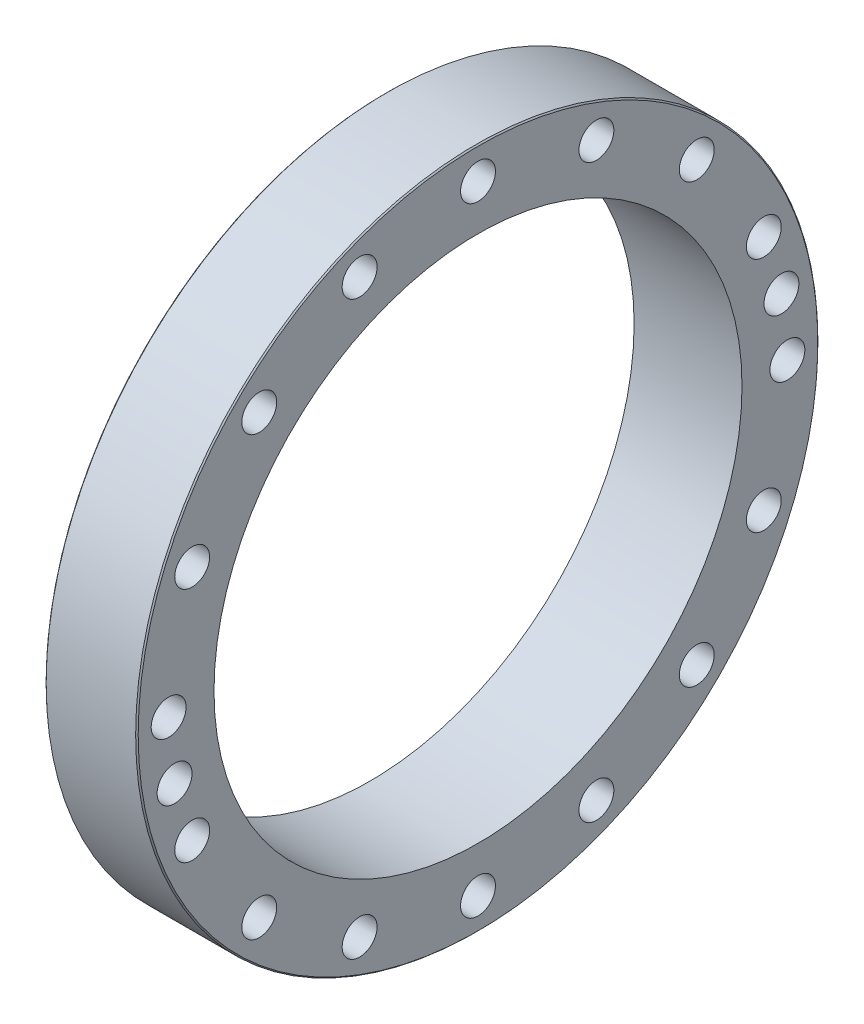
ISO-10303-21;
HEADER;
FILE_DESCRIPTION(('STEP AP214'),'2;1');
FILE_NAME('part.step','',(''),(''),'','','');
FILE_SCHEMA(('AUTOMOTIVE_DESIGN { 1 0 10303 214 1 1 1 1 }'));
ENDSEC;
DATA;
#1=APPLICATION_CONTEXT('core data for automotive mechanical design processes');
#2=APPLICATION_PROTOCOL_DEFINITION('international standard','automotive_design',2000,#1);
#3=PRODUCT_CONTEXT('',#1,'mechanical');
#4=PRODUCT('Part','Part','',(#3));
#5=PRODUCT_RELATED_PRODUCT_CATEGORY('part','',(#4));
#6=PRODUCT_DEFINITION_FORMATION('','',#4);
#7=PRODUCT_DEFINITION_CONTEXT('part definition',#1,'design');
#8=PRODUCT_DEFINITION('design','',#6,#7);
#9=PRODUCT_DEFINITION_SHAPE('','',#8);
#10=(LENGTH_UNIT() NAMED_UNIT(*) SI_UNIT(.MILLI.,.METRE.));
#11=(NAMED_UNIT(*) PLANE_ANGLE_UNIT() SI_UNIT($,.RADIAN.));
#12=(NAMED_UNIT(*) SI_UNIT($,.STERADIAN.) SOLID_ANGLE_UNIT());
#13=UNCERTAINTY_MEASURE_WITH_UNIT(LENGTH_MEASURE(1.E-05),#10,'distance_accuracy_value','');
#14=(GEOMETRIC_REPRESENTATION_CONTEXT(3) GLOBAL_UNCERTAINTY_ASSIGNED_CONTEXT((#13)) GLOBAL_UNIT_ASSIGNED_CONTEXT((#10,
#11,#12)) REPRESENTATION_CONTEXT('',''));
#15=CARTESIAN_POINT('',(0.,0.,0.));
#16=DIRECTION('',(0.,0.,1.));
#17=DIRECTION('',(1.,0.,0.));
#18=AXIS2_PLACEMENT_3D('',#15,#16,#17);
#19=CARTESIAN_POINT('',(60.1,-19.0213063965725,95.626564839315));
#20=DIRECTION('',(-1.,0.,0.));
#21=DIRECTION('',(0.,0.,1.));
#22=AXIS2_PLACEMENT_3D('',#19,#20,#21);
#23=CYLINDRICAL_SURFACE('',#22,4.25);
#24=CARTESIAN_POINT('',(66.8499999999312,-19.0213063965725,95.626564839315));
#25=DIRECTION('',(1.,0.,0.));
#26=DIRECTION('',(0.,0.195090322018536,-0.980785280402751));
#27=AXIS2_PLACEMENT_3D('',#24,#25,#26);
#28=CIRCLE('',#27,4.24999999995026);
#29=CARTESIAN_POINT('',(66.8499999999312,-18.1921725280034,91.4582273976521));
#30=VERTEX_POINT('',#29);
#31=EDGE_CURVE('E29',#30,#30,#28,.T.);
#32=ORIENTED_EDGE('',*,*,#31,.T.);
#33=EDGE_LOOP('',(#32));
#34=FACE_BOUND('',#33,.T.);
#35=CARTESIAN_POINT('',(53.3500000000231,-19.0213063965725,95.626564839315));
#36=DIRECTION('',(-1.,0.,0.));
#37=DIRECTION('',(0.,0.195090322016634,-0.98078528040313));
#38=AXIS2_PLACEMENT_3D('',#35,#36,#37);
#39=CIRCLE('',#38,4.25000000006453);
#40=CARTESIAN_POINT('',(53.3500000000231,-18.1921725279892,91.4582273975384));
#41=VERTEX_POINT('',#40);
#42=EDGE_CURVE('E172',#41,#41,#39,.T.);
#43=ORIENTED_EDGE('',*,*,#42,.T.);
#44=EDGE_LOOP('',(#43));
#45=FACE_BOUND('',#44,.T.);
#46=ADVANCED_FACE('F14',(#34,#45),#23,.F.);
#47=CARTESIAN_POINT('',(60.1,19.0213063965725,-95.626564839315));
#48=DIRECTION('',(-1.,0.,0.));
#49=DIRECTION('',(0.,0.,1.));
#50=AXIS2_PLACEMENT_3D('',#47,#48,#49);
#51=CYLINDRICAL_SURFACE('',#50,4.25);
#52=CARTESIAN_POINT('',(66.8499999999312,19.0213063965725,-95.626564839315));
#53=DIRECTION('',(1.,0.,0.));
#54=DIRECTION('',(0.,-0.195090322018536,0.980785280402751));
#55=AXIS2_PLACEMENT_3D('',#52,#53,#54);
#56=CIRCLE('',#55,4.24999999995026);
#57=CARTESIAN_POINT('',(66.8499999999312,18.1921725280034,-91.4582273976521));
#58=VERTEX_POINT('',#57);
#59=EDGE_CURVE('E178',#58,#58,#56,.T.);
#60=ORIENTED_EDGE('',*,*,#59,.T.);
#61=EDGE_LOOP('',(#60));
#62=FACE_BOUND('',#61,.T.);
#63=CARTESIAN_POINT('',(53.3500000000231,19.0213063965725,-95.626564839315));
#64=DIRECTION('',(-1.,0.,0.));
#65=DIRECTION('',(0.,-0.195090322016634,0.98078528040313));
#66=AXIS2_PLACEMENT_3D('',#63,#64,#65);
#67=CIRCLE('',#66,4.25000000006453);
#68=CARTESIAN_POINT('',(53.3500000000231,18.1921725279892,-91.4582273975384));
#69=VERTEX_POINT('',#68);
#70=EDGE_CURVE('E167',#69,#69,#67,.T.);
#71=ORIENTED_EDGE('',*,*,#70,.T.);
#72=EDGE_LOOP('',(#71));
#73=FACE_BOUND('',#72,.T.);
#74=ADVANCED_FACE('F190',(#62,#73),#51,.F.);
#75=CARTESIAN_POINT('',(67.5999999999704,-19.0213063965725,95.626564839315));
#76=DIRECTION('',(1.,0.,0.));
#77=DIRECTION('',(0.,0.,-1.));
#78=AXIS2_PLACEMENT_3D('',#75,#76,#77);
#79=CONICAL_SURFACE('',#78,4.99999999995781,0.785398163377527);
#80=CARTESIAN_POINT('',(67.5999999999704,-19.0213063965725,95.626564839315));
#81=DIRECTION('',(1.,0.,0.));
#82=DIRECTION('',(0.,0.,-1.));
#83=AXIS2_PLACEMENT_3D('',#80,#81,#82);
#84=CIRCLE('',#83,4.99999999995781);
#85=CARTESIAN_POINT('',(67.5999999999704,-19.0213063965725,90.6265648393572));
#86=VERTEX_POINT('',#85);
#87=EDGE_CURVE('E17',#86,#86,#84,.T.);
#88=ORIENTED_EDGE('',*,*,#87,.T.);
#89=EDGE_LOOP('',(#88));
#90=FACE_BOUND('',#89,.T.);
#91=ORIENTED_EDGE('',*,*,#31,.F.);
#92=EDGE_LOOP('',(#91));
#93=FACE_BOUND('',#92,.T.);
#94=ADVANCED_FACE('F187',(#90,#93),#79,.F.);
#95=CARTESIAN_POINT('',(67.5999999999704,19.0213063965725,-95.626564839315));
#96=DIRECTION('',(1.,0.,0.));
#97=DIRECTION('',(0.,0.,-1.));
#98=AXIS2_PLACEMENT_3D('',#95,#96,#97);
#99=CONICAL_SURFACE('',#98,4.99999999995781,0.785398163377527);
#100=CARTESIAN_POINT('',(67.5999999999704,19.0213063965725,-95.626564839315));
#101=DIRECTION('',(1.,0.,0.));
#102=DIRECTION('',(0.,0.,-1.));
#103=AXIS2_PLACEMENT_3D('',#100,#101,#102);
#104=CIRCLE('',#103,4.99999999995781);
#105=CARTESIAN_POINT('',(67.5999999999704,19.0213063965725,-100.626564839273));
#106=VERTEX_POINT('',#105);
#107=EDGE_CURVE('E158',#106,#106,#104,.T.);
#108=ORIENTED_EDGE('',*,*,#107,.T.);
#109=EDGE_LOOP('',(#108));
#110=FACE_BOUND('',#109,.T.);
#111=ORIENTED_EDGE('',*,*,#59,.F.);
#112=EDGE_LOOP('',(#111));
#113=FACE_BOUND('',#112,.T.);
#114=ADVANCED_FACE('F189',(#110,#113),#99,.F.);
#115=CARTESIAN_POINT('',(52.5999999999271,-19.0213063965725,95.626564839315));
#116=DIRECTION('',(-1.,0.,0.));
#117=DIRECTION('',(0.,0.,1.));
#118=AXIS2_PLACEMENT_3D('',#115,#116,#117);
#119=CONICAL_SURFACE('',#118,5.00000000013338,0.785398163417663);
#120=ORIENTED_EDGE('',*,*,#42,.F.);
#121=EDGE_LOOP('',(#120));
#122=FACE_BOUND('',#121,.T.);
#123=CARTESIAN_POINT('',(52.5999999999666,-19.0213063965725,95.626564839315));
#124=DIRECTION('',(-1.,0.,0.));
#125=DIRECTION('',(0.,0.,1.));
#126=AXIS2_PLACEMENT_3D('',#123,#124,#125);
#127=CIRCLE('',#126,5.00000000009395);
#128=CARTESIAN_POINT('',(52.5999999999666,-19.0213063965725,100.626564839409));
#129=VERTEX_POINT('',#128);
#130=EDGE_CURVE('E156',#129,#129,#127,.F.);
#131=ORIENTED_EDGE('',*,*,#130,.F.);
#132=EDGE_LOOP('',(#131));
#133=FACE_BOUND('',#132,.T.);
#134=ADVANCED_FACE('F197',(#122,#133),#119,.F.);
#135=CARTESIAN_POINT('',(52.5999999999271,19.0213063965725,-95.626564839315));
#136=DIRECTION('',(-1.,0.,0.));
#137=DIRECTION('',(0.,0.,1.));
#138=AXIS2_PLACEMENT_3D('',#135,#136,#137);
#139=CONICAL_SURFACE('',#138,5.00000000013338,0.785398163417663);
#140=ORIENTED_EDGE('',*,*,#70,.F.);
#141=EDGE_LOOP('',(#140));
#142=FACE_BOUND('',#141,.T.);
#143=CARTESIAN_POINT('',(52.5999999999666,19.0213063965725,-95.626564839315));
#144=DIRECTION('',(-1.,0.,0.));
#145=DIRECTION('',(0.,0.,1.));
#146=AXIS2_PLACEMENT_3D('',#143,#144,#145);
#147=CIRCLE('',#146,5.00000000009395);
#148=CARTESIAN_POINT('',(52.5999999999666,19.0213063965725,-90.626564839221));
#149=VERTEX_POINT('',#148);
#150=EDGE_CURVE('E153',#149,#149,#147,.F.);
#151=ORIENTED_EDGE('',*,*,#150,.F.);
#152=EDGE_LOOP('',(#151));
#153=FACE_BOUND('',#152,.T.);
#154=ADVANCED_FACE('F316',(#142,#153),#139,.F.);
#155=CARTESIAN_POINT('',(50.5,0.,0.));
#156=DIRECTION('',(-1.,0.,0.));
#157=DIRECTION('',(0.,0.,1.));
#158=AXIS2_PLACEMENT_3D('',#155,#156,#157);
#159=CYLINDRICAL_SURFACE('',#158,88.5);
#160=CARTESIAN_POINT('',(52.6,0.,0.));
#161=DIRECTION('',(-1.,0.,0.));
#162=DIRECTION('',(0.,0.,1.));
#163=AXIS2_PLACEMENT_3D('',#160,#161,#162);
#164=CIRCLE('',#163,88.5);
#165=CARTESIAN_POINT('',(52.6,0.,88.5));
#166=VERTEX_POINT('',#165);
#167=EDGE_CURVE('E147',#166,#166,#164,.F.);
#168=ORIENTED_EDGE('',*,*,#167,.F.);
#169=EDGE_LOOP('',(#168));
#170=FACE_BOUND('',#169,.T.);
#171=CARTESIAN_POINT('',(48.4,0.,0.));
#172=DIRECTION('',(1.,0.,0.));
#173=DIRECTION('',(0.,0.,1.));
#174=AXIS2_PLACEMENT_3D('',#171,#172,#173);
#175=CIRCLE('',#174,88.5);
#176=CARTESIAN_POINT('',(48.4,0.,88.5));
#177=VERTEX_POINT('',#176);
#178=EDGE_CURVE('E163',#177,#177,#175,.F.);
#179=ORIENTED_EDGE('',*,*,#178,.F.);
#180=EDGE_LOOP('',(#179));
#181=FACE_BOUND('',#180,.T.);
#182=ADVANCED_FACE('F313',(#170,#181),#159,.T.);
#183=CARTESIAN_POINT('',(48.4,0.,0.));
#184=DIRECTION('',(1.,0.,0.));
#185=DIRECTION('',(0.,0.,-1.));
#186=AXIS2_PLACEMENT_3D('',#183,#184,#185);
#187=CONICAL_SURFACE('',#186,88.5,0.785398163397448);
#188=ORIENTED_EDGE('',*,*,#178,.T.);
#189=EDGE_LOOP('',(#188));
#190=FACE_BOUND('',#189,.T.);
#191=CARTESIAN_POINT('',(47.6,0.,0.));
#192=DIRECTION('',(1.,0.,0.));
#193=DIRECTION('',(0.,0.,-1.));
#194=AXIS2_PLACEMENT_3D('',#191,#192,#193);
#195=CIRCLE('',#194,87.7);
#196=CARTESIAN_POINT('',(47.6,0.,-87.7));
#197=VERTEX_POINT('',#196);
#198=EDGE_CURVE('E144',#197,#197,#195,.F.);
#199=ORIENTED_EDGE('',*,*,#198,.F.);
#200=EDGE_LOOP('',(#199));
#201=FACE_BOUND('',#200,.T.);
#202=ADVANCED_FACE('F309',(#190,#201),#187,.T.);
#203=CARTESIAN_POINT('',(53.,0.,0.));
#204=DIRECTION('',(1.,0.,0.));
#205=DIRECTION('',(0.,0.,-1.));
#206=AXIS2_PLACEMENT_3D('',#203,#204,#205);
#207=CONICAL_SURFACE('',#206,107.5,0.785398163397448);
#208=CARTESIAN_POINT('',(53.,0.,0.));
#209=DIRECTION('',(-1.,0.,0.));
#210=DIRECTION('',(0.,0.,1.));
#211=AXIS2_PLACEMENT_3D('',#208,#209,#210);
#212=CIRCLE('',#211,107.5);
#213=CARTESIAN_POINT('',(53.,0.,107.5));
#214=VERTEX_POINT('',#213);
#215=EDGE_CURVE('E143',#214,#214,#212,.F.);
#216=ORIENTED_EDGE('',*,*,#215,.F.);
#217=EDGE_LOOP('',(#216));
#218=FACE_BOUND('',#217,.T.);
#219=CARTESIAN_POINT('',(52.6,0.,0.));
#220=DIRECTION('',(1.,0.,0.));
#221=DIRECTION('',(0.,0.,-1.));
#222=AXIS2_PLACEMENT_3D('',#219,#220,#221);
#223=CIRCLE('',#222,107.1);
#224=CARTESIAN_POINT('',(52.6,0.,-107.1));
#225=VERTEX_POINT('',#224);
#226=EDGE_CURVE('E150',#225,#225,#223,.F.);
#227=ORIENTED_EDGE('',*,*,#226,.F.);
#228=EDGE_LOOP('',(#227));
#229=FACE_BOUND('',#228,.T.);
#230=ADVANCED_FACE('F305',(#218,#229),#207,.T.);
#231=CARTESIAN_POINT('',(67.6,-19.5578047821169,98.3237243604239));
#232=DIRECTION('',(-1.,0.,0.));
#233=DIRECTION('',(0.,0.,1.));
#234=AXIS2_PLACEMENT_3D('',#231,#232,#233);
#235=PLANE('',#234);
#236=CARTESIAN_POINT('',(67.6,-19.0213063965725,95.626564839315));
#237=DIRECTION('',(-1.,0.,0.));
#238=DIRECTION('',(0.,0.,1.));
#239=AXIS2_PLACEMENT_3D('',#236,#237,#238);
#240=CIRCLE('',#239,5.5);
#241=CARTESIAN_POINT('',(67.6,-19.0213063965725,101.126564839315));
#242=VERTEX_POINT('',#241);
#243=EDGE_CURVE('E140',#242,#242,#240,.F.);
#244=ORIENTED_EDGE('',*,*,#243,.T.);
#245=EDGE_LOOP('',(#244));
#246=FACE_BOUND('',#245,.T.);
#247=ORIENTED_EDGE('',*,*,#87,.F.);
#248=EDGE_LOOP('',(#247));
#249=FACE_BOUND('',#248,.T.);
#250=ADVANCED_FACE('F301',(#246,#249),#235,.F.);
#251=CARTESIAN_POINT('',(67.6,19.5578047821169,-98.3237243604239));
#252=DIRECTION('',(-1.,0.,0.));
#253=DIRECTION('',(0.,0.,1.));
#254=AXIS2_PLACEMENT_3D('',#251,#252,#253);
#255=PLANE('',#254);
#256=CARTESIAN_POINT('',(67.6,19.0213063965725,-95.626564839315));
#257=DIRECTION('',(-1.,0.,0.));
#258=DIRECTION('',(0.,0.,1.));
#259=AXIS2_PLACEMENT_3D('',#256,#257,#258);
#260=CIRCLE('',#259,5.5);
#261=CARTESIAN_POINT('',(67.6,19.0213063965725,-90.126564839315));
#262=VERTEX_POINT('',#261);
#263=EDGE_CURVE('E137',#262,#262,#260,.F.);
#264=ORIENTED_EDGE('',*,*,#263,.T.);
#265=EDGE_LOOP('',(#264));
#266=FACE_BOUND('',#265,.T.);
#267=ORIENTED_EDGE('',*,*,#107,.F.);
#268=EDGE_LOOP('',(#267));
#269=FACE_BOUND('',#268,.T.);
#270=ADVANCED_FACE('F297',(#266,#269),#255,.F.);
#271=CARTESIAN_POINT('',(52.6,0.,97.8));
#272=DIRECTION('',(-1.,0.,0.));
#273=DIRECTION('',(0.,0.,1.));
#274=AXIS2_PLACEMENT_3D('',#271,#272,#273);
#275=PLANE('',#274);
#276=ORIENTED_EDGE('',*,*,#167,.T.);
#277=EDGE_LOOP('',(#276));
#278=FACE_BOUND('',#277,.T.);
#279=ORIENTED_EDGE('',*,*,#226,.T.);
#280=EDGE_LOOP('',(#279));
#281=FACE_BOUND('',#280,.T.);
#282=CARTESIAN_POINT('',(52.6,0.,-97.5));
#283=DIRECTION('',(-1.,0.,0.));
#284=DIRECTION('',(0.,0.,1.));
#285=AXIS2_PLACEMENT_3D('',#282,#283,#284);
#286=CIRCLE('',#285,5.5);
#287=CARTESIAN_POINT('',(52.6,0.,-92.));
#288=VERTEX_POINT('',#287);
#289=EDGE_CURVE('E89',#288,#288,#286,.F.);
#290=ORIENTED_EDGE('',*,*,#289,.T.);
#291=EDGE_LOOP('',(#290));
#292=FACE_BOUND('',#291,.T.);
#293=CARTESIAN_POINT('',(52.6,37.3116346555963,-90.0782544198505));
#294=DIRECTION('',(-1.,0.,0.));
#295=DIRECTION('',(0.,0.,1.));
#296=AXIS2_PLACEMENT_3D('',#293,#294,#295);
#297=CIRCLE('',#296,5.5);
#298=CARTESIAN_POINT('',(52.6,37.3116346555963,-84.5782544198505));
#299=VERTEX_POINT('',#298);
#300=EDGE_CURVE('E92',#299,#299,#297,.F.);
#301=ORIENTED_EDGE('',*,*,#300,.T.);
#302=EDGE_LOOP('',(#301));
#303=FACE_BOUND('',#302,.T.);
#304=CARTESIAN_POINT('',(52.6,68.9429111656884,-68.9429111656884));
#305=DIRECTION('',(-1.,0.,0.));
#306=DIRECTION('',(0.,0.,1.));
#307=AXIS2_PLACEMENT_3D('',#304,#305,#306);
#308=CIRCLE('',#307,5.5);
#309=CARTESIAN_POINT('',(52.6,68.9429111656884,-63.4429111656884));
#310=VERTEX_POINT('',#309);
#311=EDGE_CURVE('E95',#310,#310,#308,.F.);
#312=ORIENTED_EDGE('',*,*,#311,.T.);
#313=EDGE_LOOP('',(#312));
#314=FACE_BOUND('',#313,.T.);
#315=CARTESIAN_POINT('',(52.6,90.0782544198505,-37.3116346555963));
#316=DIRECTION('',(-1.,0.,0.));
#317=DIRECTION('',(0.,0.,1.));
#318=AXIS2_PLACEMENT_3D('',#315,#316,#317);
#319=CIRCLE('',#318,5.5);
#320=CARTESIAN_POINT('',(52.6,90.0782544198505,-31.8116346555963));
#321=VERTEX_POINT('',#320);
#322=EDGE_CURVE('E98',#321,#321,#319,.F.);
#323=ORIENTED_EDGE('',*,*,#322,.T.);
#324=EDGE_LOOP('',(#323));
#325=FACE_BOUND('',#324,.T.);
#326=CARTESIAN_POINT('',(52.6,97.5,0.));
#327=DIRECTION('',(-1.,0.,0.));
#328=DIRECTION('',(0.,0.,1.));
#329=AXIS2_PLACEMENT_3D('',#326,#327,#328);
#330=CIRCLE('',#329,5.5);
#331=CARTESIAN_POINT('',(52.6,97.5,5.5));
#332=VERTEX_POINT('',#331);
#333=EDGE_CURVE('E101',#332,#332,#330,.F.);
#334=ORIENTED_EDGE('',*,*,#333,.T.);
#335=EDGE_LOOP('',(#334));
#336=FACE_BOUND('',#335,.T.);
#337=CARTESIAN_POINT('',(52.6,90.0782544198505,37.3116346555963));
#338=DIRECTION('',(-1.,0.,0.));
#339=DIRECTION('',(0.,0.,1.));
#340=AXIS2_PLACEMENT_3D('',#337,#338,#339);
#341=CIRCLE('',#340,5.5);
#342=CARTESIAN_POINT('',(52.6,90.0782544198505,42.8116346555963));
#343=VERTEX_POINT('',#342);
#344=EDGE_CURVE('E104',#343,#343,#341,.F.);
#345=ORIENTED_EDGE('',*,*,#344,.T.);
#346=EDGE_LOOP('',(#345));
#347=FACE_BOUND('',#346,.T.);
#348=CARTESIAN_POINT('',(52.6,68.9429111656884,68.9429111656884));
#349=DIRECTION('',(-1.,0.,0.));
#350=DIRECTION('',(0.,0.,1.));
#351=AXIS2_PLACEMENT_3D('',#348,#349,#350);
#352=CIRCLE('',#351,5.5);
#353=CARTESIAN_POINT('',(52.6,68.9429111656884,74.4429111656884));
#354=VERTEX_POINT('',#353);
#355=EDGE_CURVE('E107',#354,#354,#352,.F.);
#356=ORIENTED_EDGE('',*,*,#355,.T.);
#357=EDGE_LOOP('',(#356));
#358=FACE_BOUND('',#357,.T.);
#359=CARTESIAN_POINT('',(52.6,37.3116346555962,90.0782544198505));
#360=DIRECTION('',(-1.,0.,0.));
#361=DIRECTION('',(0.,0.,1.));
#362=AXIS2_PLACEMENT_3D('',#359,#360,#361);
#363=CIRCLE('',#362,5.5);
#364=CARTESIAN_POINT('',(52.6,37.3116346555962,95.5782544198505));
#365=VERTEX_POINT('',#364);
#366=EDGE_CURVE('E110',#365,#365,#363,.F.);
#367=ORIENTED_EDGE('',*,*,#366,.T.);
#368=EDGE_LOOP('',(#367));
#369=FACE_BOUND('',#368,.T.);
#370=CARTESIAN_POINT('',(52.6,0.,97.5));
#371=DIRECTION('',(-1.,0.,0.));
#372=DIRECTION('',(0.,0.,1.));
#373=AXIS2_PLACEMENT_3D('',#370,#371,#372);
#374=CIRCLE('',#373,5.5);
#375=CARTESIAN_POINT('',(52.6,0.,103.));
#376=VERTEX_POINT('',#375);
#377=EDGE_CURVE('E113',#376,#376,#374,.F.);
#378=ORIENTED_EDGE('',*,*,#377,.T.);
#379=EDGE_LOOP('',(#378));
#380=FACE_BOUND('',#379,.T.);
#381=CARTESIAN_POINT('',(52.6,-37.3116346555962,90.0782544198505));
#382=DIRECTION('',(-1.,0.,0.));
#383=DIRECTION('',(0.,0.,1.));
#384=AXIS2_PLACEMENT_3D('',#381,#382,#383);
#385=CIRCLE('',#384,5.5);
#386=CARTESIAN_POINT('',(52.6,-37.3116346555962,95.5782544198505));
#387=VERTEX_POINT('',#386);
#388=EDGE_CURVE('E116',#387,#387,#385,.F.);
#389=ORIENTED_EDGE('',*,*,#388,.T.);
#390=EDGE_LOOP('',(#389));
#391=FACE_BOUND('',#390,.T.);
#392=CARTESIAN_POINT('',(52.6,-68.9429111656884,68.9429111656884));
#393=DIRECTION('',(-1.,0.,0.));
#394=DIRECTION('',(0.,0.,1.));
#395=AXIS2_PLACEMENT_3D('',#392,#393,#394);
#396=CIRCLE('',#395,5.5);
#397=CARTESIAN_POINT('',(52.6,-68.9429111656884,74.4429111656884));
#398=VERTEX_POINT('',#397);
#399=EDGE_CURVE('E119',#398,#398,#396,.F.);
#400=ORIENTED_EDGE('',*,*,#399,.T.);
#401=EDGE_LOOP('',(#400));
#402=FACE_BOUND('',#401,.T.);
#403=CARTESIAN_POINT('',(52.6,-90.0782544198505,37.3116346555962));
#404=DIRECTION('',(-1.,0.,0.));
#405=DIRECTION('',(0.,0.,1.));
#406=AXIS2_PLACEMENT_3D('',#403,#404,#405);
#407=CIRCLE('',#406,5.5);
#408=CARTESIAN_POINT('',(52.6,-90.0782544198505,42.8116346555962));
#409=VERTEX_POINT('',#408);
#410=EDGE_CURVE('E122',#409,#409,#407,.F.);
#411=ORIENTED_EDGE('',*,*,#410,.T.);
#412=EDGE_LOOP('',(#411));
#413=FACE_BOUND('',#412,.T.);
#414=CARTESIAN_POINT('',(52.6,-97.5,0.));
#415=DIRECTION('',(-1.,0.,0.));
#416=DIRECTION('',(0.,0.,1.));
#417=AXIS2_PLACEMENT_3D('',#414,#415,#416);
#418=CIRCLE('',#417,5.5);
#419=CARTESIAN_POINT('',(52.6,-97.5,5.5));
#420=VERTEX_POINT('',#419);
#421=EDGE_CURVE('E125',#420,#420,#418,.F.);
#422=ORIENTED_EDGE('',*,*,#421,.T.);
#423=EDGE_LOOP('',(#422));
#424=FACE_BOUND('',#423,.T.);
#425=CARTESIAN_POINT('',(52.6,-90.0782544198505,-37.3116346555963));
#426=DIRECTION('',(-1.,0.,0.));
#427=DIRECTION('',(0.,0.,1.));
#428=AXIS2_PLACEMENT_3D('',#425,#426,#427);
#429=CIRCLE('',#428,5.5);
#430=CARTESIAN_POINT('',(52.6,-90.0782544198505,-31.8116346555963));
#431=VERTEX_POINT('',#430);
#432=EDGE_CURVE('E128',#431,#431,#429,.F.);
#433=ORIENTED_EDGE('',*,*,#432,.T.);
#434=EDGE_LOOP('',(#433));
#435=FACE_BOUND('',#434,.T.);
#436=CARTESIAN_POINT('',(52.6,-68.9429111656883,-68.9429111656884));
#437=DIRECTION('',(-1.,0.,0.));
#438=DIRECTION('',(0.,0.,1.));
#439=AXIS2_PLACEMENT_3D('',#436,#437,#438);
#440=CIRCLE('',#439,5.5);
#441=CARTESIAN_POINT('',(52.6,-68.9429111656883,-63.4429111656884));
#442=VERTEX_POINT('',#441);
#443=EDGE_CURVE('E131',#442,#442,#440,.F.);
#444=ORIENTED_EDGE('',*,*,#443,.T.);
#445=EDGE_LOOP('',(#444));
#446=FACE_BOUND('',#445,.T.);
#447=CARTESIAN_POINT('',(52.6,-37.3116346555962,-90.0782544198505));
#448=DIRECTION('',(-1.,0.,0.));
#449=DIRECTION('',(0.,0.,1.));
#450=AXIS2_PLACEMENT_3D('',#447,#448,#449);
#451=CIRCLE('',#450,5.5);
#452=CARTESIAN_POINT('',(52.6,-37.3116346555962,-84.5782544198505));
#453=VERTEX_POINT('',#452);
#454=EDGE_CURVE('E134',#453,#453,#451,.F.);
#455=ORIENTED_EDGE('',*,*,#454,.T.);
#456=EDGE_LOOP('',(#455));
#457=FACE_BOUND('',#456,.T.);
#458=ORIENTED_EDGE('',*,*,#150,.T.);
#459=EDGE_LOOP('',(#458));
#460=FACE_BOUND('',#459,.T.);
#461=ORIENTED_EDGE('',*,*,#130,.T.);
#462=EDGE_LOOP('',(#461));
#463=FACE_BOUND('',#462,.T.);
#464=ADVANCED_FACE('F293',(#278,#281,#292,#303,#314,#325,#336,#347,#358,#369,#380,#391,#402,
#413,#424,#435,#446,#457,#460,#463),#275,.T.);
#465=CARTESIAN_POINT('',(47.6,0.,85.452));
#466=DIRECTION('',(-1.,0.,0.));
#467=DIRECTION('',(0.,0.,1.));
#468=AXIS2_PLACEMENT_3D('',#465,#466,#467);
#469=PLANE('',#468);
#470=CARTESIAN_POINT('',(47.6,0.,0.));
#471=DIRECTION('',(-1.,0.,0.));
#472=DIRECTION('',(0.,0.,1.));
#473=AXIS2_PLACEMENT_3D('',#470,#471,#472);
#474=CIRCLE('',#473,83.204);
#475=CARTESIAN_POINT('',(47.6,0.,83.204));
#476=VERTEX_POINT('',#475);
#477=EDGE_CURVE('E86',#476,#476,#474,.F.);
#478=ORIENTED_EDGE('',*,*,#477,.T.);
#479=EDGE_LOOP('',(#478));
#480=FACE_BOUND('',#479,.T.);
#481=ORIENTED_EDGE('',*,*,#198,.T.);
#482=EDGE_LOOP('',(#481));
#483=FACE_BOUND('',#482,.T.);
#484=ADVANCED_FACE('F289',(#480,#483),#469,.T.);
#485=CARTESIAN_POINT('',(67.1,0.,0.));
#486=DIRECTION('',(-1.,0.,0.));
#487=DIRECTION('',(0.,0.,1.));
#488=AXIS2_PLACEMENT_3D('',#485,#486,#487);
#489=CYLINDRICAL_SURFACE('',#488,107.5);
#490=CARTESIAN_POINT('',(81.2,0.,0.));
#491=DIRECTION('',(-1.,0.,0.));
#492=DIRECTION('',(0.,0.,1.));
#493=AXIS2_PLACEMENT_3D('',#490,#491,#492);
#494=CIRCLE('',#493,107.5);
#495=CARTESIAN_POINT('',(81.2,0.,107.5));
#496=VERTEX_POINT('',#495);
#497=EDGE_CURVE('E85',#496,#496,#494,.F.);
#498=ORIENTED_EDGE('',*,*,#497,.F.);
#499=EDGE_LOOP('',(#498));
#500=FACE_BOUND('',#499,.T.);
#501=ORIENTED_EDGE('',*,*,#215,.T.);
#502=EDGE_LOOP('',(#501));
#503=FACE_BOUND('',#502,.T.);
#504=ADVANCED_FACE('F285',(#500,#503),#489,.T.);
#505=CARTESIAN_POINT('',(74.6,-19.0213063965725,95.626564839315));
#506=DIRECTION('',(-1.,0.,0.));
#507=DIRECTION('',(0.,0.,1.));
#508=AXIS2_PLACEMENT_3D('',#505,#506,#507);
#509=CYLINDRICAL_SURFACE('',#508,5.5);
#510=CARTESIAN_POINT('',(81.6,-19.0213063965725,95.626564839315));
#511=DIRECTION('',(-1.,0.,0.));
#512=DIRECTION('',(0.,0.,1.));
#513=AXIS2_PLACEMENT_3D('',#510,#511,#512);
#514=CIRCLE('',#513,5.5);
#515=CARTESIAN_POINT('',(81.6,-19.0213063965725,101.126564839315));
#516=VERTEX_POINT('',#515);
#517=EDGE_CURVE('E82',#516,#516,#514,.T.);
#518=ORIENTED_EDGE('',*,*,#517,.F.);
#519=EDGE_LOOP('',(#518));
#520=FACE_BOUND('',#519,.T.);
#521=ORIENTED_EDGE('',*,*,#243,.F.);
#522=EDGE_LOOP('',(#521));
#523=FACE_BOUND('',#522,.T.);
#524=ADVANCED_FACE('F281',(#520,#523),#509,.F.);
#525=CARTESIAN_POINT('',(74.6,19.0213063965725,-95.626564839315));
#526=DIRECTION('',(-1.,0.,0.));
#527=DIRECTION('',(0.,0.,1.));
#528=AXIS2_PLACEMENT_3D('',#525,#526,#527);
#529=CYLINDRICAL_SURFACE('',#528,5.5);
#530=CARTESIAN_POINT('',(81.6,19.0213063965725,-95.626564839315));
#531=DIRECTION('',(-1.,0.,0.));
#532=DIRECTION('',(0.,0.,1.));
#533=AXIS2_PLACEMENT_3D('',#530,#531,#532);
#534=CIRCLE('',#533,5.5);
#535=CARTESIAN_POINT('',(81.6,19.0213063965725,-90.126564839315));
#536=VERTEX_POINT('',#535);
#537=EDGE_CURVE('E79',#536,#536,#534,.T.);
#538=ORIENTED_EDGE('',*,*,#537,.F.);
#539=EDGE_LOOP('',(#538));
#540=FACE_BOUND('',#539,.T.);
#541=ORIENTED_EDGE('',*,*,#263,.F.);
#542=EDGE_LOOP('',(#541));
#543=FACE_BOUND('',#542,.T.);
#544=ADVANCED_FACE('F277',(#540,#543),#529,.F.);
#545=CARTESIAN_POINT('',(67.1,-37.3116346555962,-90.0782544198505));
#546=DIRECTION('',(-1.,0.,0.));
#547=DIRECTION('',(0.,0.,1.));
#548=AXIS2_PLACEMENT_3D('',#545,#546,#547);
#549=CYLINDRICAL_SURFACE('',#548,5.5);
#550=CARTESIAN_POINT('',(81.6,-37.3116346555962,-90.0782544198505));
#551=DIRECTION('',(-1.,0.,0.));
#552=DIRECTION('',(0.,0.,1.));
#553=AXIS2_PLACEMENT_3D('',#550,#551,#552);
#554=CIRCLE('',#553,5.5);
#555=CARTESIAN_POINT('',(81.6,-37.3116346555962,-84.5782544198505));
#556=VERTEX_POINT('',#555);
#557=EDGE_CURVE('E76',#556,#556,#554,.T.);
#558=ORIENTED_EDGE('',*,*,#557,.F.);
#559=EDGE_LOOP('',(#558));
#560=FACE_BOUND('',#559,.T.);
#561=ORIENTED_EDGE('',*,*,#454,.F.);
#562=EDGE_LOOP('',(#561));
#563=FACE_BOUND('',#562,.T.);
#564=ADVANCED_FACE('F273',(#560,#563),#549,.F.);
#565=CARTESIAN_POINT('',(67.1,-68.9429111656883,-68.9429111656884));
#566=DIRECTION('',(-1.,0.,0.));
#567=DIRECTION('',(0.,0.,1.));
#568=AXIS2_PLACEMENT_3D('',#565,#566,#567);
#569=CYLINDRICAL_SURFACE('',#568,5.5);
#570=CARTESIAN_POINT('',(81.6,-68.9429111656883,-68.9429111656884));
#571=DIRECTION('',(-1.,0.,0.));
#572=DIRECTION('',(0.,0.,1.));
#573=AXIS2_PLACEMENT_3D('',#570,#571,#572);
#574=CIRCLE('',#573,5.5);
#575=CARTESIAN_POINT('',(81.6,-68.9429111656883,-63.4429111656884));
#576=VERTEX_POINT('',#575);
#577=EDGE_CURVE('E73',#576,#576,#574,.T.);
#578=ORIENTED_EDGE('',*,*,#577,.F.);
#579=EDGE_LOOP('',(#578));
#580=FACE_BOUND('',#579,.T.);
#581=ORIENTED_EDGE('',*,*,#443,.F.);
#582=EDGE_LOOP('',(#581));
#583=FACE_BOUND('',#582,.T.);
#584=ADVANCED_FACE('F269',(#580,#583),#569,.F.);
#585=CARTESIAN_POINT('',(67.1,-90.0782544198505,-37.3116346555963));
#586=DIRECTION('',(-1.,0.,0.));
#587=DIRECTION('',(0.,0.,1.));
#588=AXIS2_PLACEMENT_3D('',#585,#586,#587);
#589=CYLINDRICAL_SURFACE('',#588,5.5);
#590=CARTESIAN_POINT('',(81.6,-90.0782544198505,-37.3116346555963));
#591=DIRECTION('',(-1.,0.,0.));
#592=DIRECTION('',(0.,0.,1.));
#593=AXIS2_PLACEMENT_3D('',#590,#591,#592);
#594=CIRCLE('',#593,5.5);
#595=CARTESIAN_POINT('',(81.6,-90.0782544198505,-31.8116346555963));
#596=VERTEX_POINT('',#595);
#597=EDGE_CURVE('E70',#596,#596,#594,.T.);
#598=ORIENTED_EDGE('',*,*,#597,.F.);
#599=EDGE_LOOP('',(#598));
#600=FACE_BOUND('',#599,.T.);
#601=ORIENTED_EDGE('',*,*,#432,.F.);
#602=EDGE_LOOP('',(#601));
#603=FACE_BOUND('',#602,.T.);
#604=ADVANCED_FACE('F265',(#600,#603),#589,.F.);
#605=CARTESIAN_POINT('',(67.1,-97.5,0.));
#606=DIRECTION('',(-1.,0.,0.));
#607=DIRECTION('',(0.,0.,1.));
#608=AXIS2_PLACEMENT_3D('',#605,#606,#607);
#609=CYLINDRICAL_SURFACE('',#608,5.5);
#610=CARTESIAN_POINT('',(81.6,-97.5,0.));
#611=DIRECTION('',(-1.,0.,0.));
#612=DIRECTION('',(0.,0.,1.));
#613=AXIS2_PLACEMENT_3D('',#610,#611,#612);
#614=CIRCLE('',#613,5.5);
#615=CARTESIAN_POINT('',(81.6,-97.5,5.5));
#616=VERTEX_POINT('',#615);
#617=EDGE_CURVE('E67',#616,#616,#614,.T.);
#618=ORIENTED_EDGE('',*,*,#617,.F.);
#619=EDGE_LOOP('',(#618));
#620=FACE_BOUND('',#619,.T.);
#621=ORIENTED_EDGE('',*,*,#421,.F.);
#622=EDGE_LOOP('',(#621));
#623=FACE_BOUND('',#622,.T.);
#624=ADVANCED_FACE('F261',(#620,#623),#609,.F.);
#625=CARTESIAN_POINT('',(67.1,-90.0782544198505,37.3116346555962));
#626=DIRECTION('',(-1.,0.,0.));
#627=DIRECTION('',(0.,0.,1.));
#628=AXIS2_PLACEMENT_3D('',#625,#626,#627);
#629=CYLINDRICAL_SURFACE('',#628,5.5);
#630=CARTESIAN_POINT('',(81.6,-90.0782544198505,37.3116346555962));
#631=DIRECTION('',(-1.,0.,0.));
#632=DIRECTION('',(0.,0.,1.));
#633=AXIS2_PLACEMENT_3D('',#630,#631,#632);
#634=CIRCLE('',#633,5.5);
#635=CARTESIAN_POINT('',(81.6,-90.0782544198505,42.8116346555962));
#636=VERTEX_POINT('',#635);
#637=EDGE_CURVE('E64',#636,#636,#634,.T.);
#638=ORIENTED_EDGE('',*,*,#637,.F.);
#639=EDGE_LOOP('',(#638));
#640=FACE_BOUND('',#639,.T.);
#641=ORIENTED_EDGE('',*,*,#410,.F.);
#642=EDGE_LOOP('',(#641));
#643=FACE_BOUND('',#642,.T.);
#644=ADVANCED_FACE('F257',(#640,#643),#629,.F.);
#645=CARTESIAN_POINT('',(67.1,-68.9429111656884,68.9429111656884));
#646=DIRECTION('',(-1.,0.,0.));
#647=DIRECTION('',(0.,0.,1.));
#648=AXIS2_PLACEMENT_3D('',#645,#646,#647);
#649=CYLINDRICAL_SURFACE('',#648,5.5);
#650=CARTESIAN_POINT('',(81.6,-68.9429111656884,68.9429111656884));
#651=DIRECTION('',(-1.,0.,0.));
#652=DIRECTION('',(0.,0.,1.));
#653=AXIS2_PLACEMENT_3D('',#650,#651,#652);
#654=CIRCLE('',#653,5.5);
#655=CARTESIAN_POINT('',(81.6,-68.9429111656884,74.4429111656884));
#656=VERTEX_POINT('',#655);
#657=EDGE_CURVE('E61',#656,#656,#654,.T.);
#658=ORIENTED_EDGE('',*,*,#657,.F.);
#659=EDGE_LOOP('',(#658));
#660=FACE_BOUND('',#659,.T.);
#661=ORIENTED_EDGE('',*,*,#399,.F.);
#662=EDGE_LOOP('',(#661));
#663=FACE_BOUND('',#662,.T.);
#664=ADVANCED_FACE('F253',(#660,#663),#649,.F.);
#665=CARTESIAN_POINT('',(67.1,-37.3116346555962,90.0782544198505));
#666=DIRECTION('',(-1.,0.,0.));
#667=DIRECTION('',(0.,0.,1.));
#668=AXIS2_PLACEMENT_3D('',#665,#666,#667);
#669=CYLINDRICAL_SURFACE('',#668,5.5);
#670=CARTESIAN_POINT('',(81.6,-37.3116346555962,90.0782544198505));
#671=DIRECTION('',(-1.,0.,0.));
#672=DIRECTION('',(0.,0.,1.));
#673=AXIS2_PLACEMENT_3D('',#670,#671,#672);
#674=CIRCLE('',#673,5.5);
#675=CARTESIAN_POINT('',(81.6,-37.3116346555962,95.5782544198505));
#676=VERTEX_POINT('',#675);
#677=EDGE_CURVE('E58',#676,#676,#674,.T.);
#678=ORIENTED_EDGE('',*,*,#677,.F.);
#679=EDGE_LOOP('',(#678));
#680=FACE_BOUND('',#679,.T.);
#681=ORIENTED_EDGE('',*,*,#388,.F.);
#682=EDGE_LOOP('',(#681));
#683=FACE_BOUND('',#682,.T.);
#684=ADVANCED_FACE('F249',(#680,#683),#669,.F.);
#685=CARTESIAN_POINT('',(67.1,0.,97.5));
#686=DIRECTION('',(-1.,0.,0.));
#687=DIRECTION('',(0.,0.,1.));
#688=AXIS2_PLACEMENT_3D('',#685,#686,#687);
#689=CYLINDRICAL_SURFACE('',#688,5.5);
#690=CARTESIAN_POINT('',(81.6,0.,97.5));
#691=DIRECTION('',(-1.,0.,0.));
#692=DIRECTION('',(0.,0.,1.));
#693=AXIS2_PLACEMENT_3D('',#690,#691,#692);
#694=CIRCLE('',#693,5.5);
#695=CARTESIAN_POINT('',(81.6,0.,103.));
#696=VERTEX_POINT('',#695);
#697=EDGE_CURVE('E55',#696,#696,#694,.T.);
#698=ORIENTED_EDGE('',*,*,#697,.F.);
#699=EDGE_LOOP('',(#698));
#700=FACE_BOUND('',#699,.T.);
#701=ORIENTED_EDGE('',*,*,#377,.F.);
#702=EDGE_LOOP('',(#701));
#703=FACE_BOUND('',#702,.T.);
#704=ADVANCED_FACE('F245',(#700,#703),#689,.F.);
#705=CARTESIAN_POINT('',(67.1,37.3116346555962,90.0782544198505));
#706=DIRECTION('',(-1.,0.,0.));
#707=DIRECTION('',(0.,0.,1.));
#708=AXIS2_PLACEMENT_3D('',#705,#706,#707);
#709=CYLINDRICAL_SURFACE('',#708,5.5);
#710=CARTESIAN_POINT('',(81.6,37.3116346555962,90.0782544198505));
#711=DIRECTION('',(-1.,0.,0.));
#712=DIRECTION('',(0.,0.,1.));
#713=AXIS2_PLACEMENT_3D('',#710,#711,#712);
#714=CIRCLE('',#713,5.5);
#715=CARTESIAN_POINT('',(81.6,37.3116346555962,95.5782544198505));
#716=VERTEX_POINT('',#715);
#717=EDGE_CURVE('E52',#716,#716,#714,.T.);
#718=ORIENTED_EDGE('',*,*,#717,.F.);
#719=EDGE_LOOP('',(#718));
#720=FACE_BOUND('',#719,.T.);
#721=ORIENTED_EDGE('',*,*,#366,.F.);
#722=EDGE_LOOP('',(#721));
#723=FACE_BOUND('',#722,.T.);
#724=ADVANCED_FACE('F241',(#720,#723),#709,.F.);
#725=CARTESIAN_POINT('',(67.1,68.9429111656884,68.9429111656884));
#726=DIRECTION('',(-1.,0.,0.));
#727=DIRECTION('',(0.,0.,1.));
#728=AXIS2_PLACEMENT_3D('',#725,#726,#727);
#729=CYLINDRICAL_SURFACE('',#728,5.5);
#730=CARTESIAN_POINT('',(81.6,68.9429111656884,68.9429111656884));
#731=DIRECTION('',(-1.,0.,0.));
#732=DIRECTION('',(0.,0.,1.));
#733=AXIS2_PLACEMENT_3D('',#730,#731,#732);
#734=CIRCLE('',#733,5.5);
#735=CARTESIAN_POINT('',(81.6,68.9429111656884,74.4429111656884));
#736=VERTEX_POINT('',#735);
#737=EDGE_CURVE('E49',#736,#736,#734,.T.);
#738=ORIENTED_EDGE('',*,*,#737,.F.);
#739=EDGE_LOOP('',(#738));
#740=FACE_BOUND('',#739,.T.);
#741=ORIENTED_EDGE('',*,*,#355,.F.);
#742=EDGE_LOOP('',(#741));
#743=FACE_BOUND('',#742,.T.);
#744=ADVANCED_FACE('F237',(#740,#743),#729,.F.);
#745=CARTESIAN_POINT('',(67.1,90.0782544198505,37.3116346555963));
#746=DIRECTION('',(-1.,0.,0.));
#747=DIRECTION('',(0.,0.,1.));
#748=AXIS2_PLACEMENT_3D('',#745,#746,#747);
#749=CYLINDRICAL_SURFACE('',#748,5.5);
#750=CARTESIAN_POINT('',(81.6,90.0782544198505,37.3116346555963));
#751=DIRECTION('',(-1.,0.,0.));
#752=DIRECTION('',(0.,0.,1.));
#753=AXIS2_PLACEMENT_3D('',#750,#751,#752);
#754=CIRCLE('',#753,5.5);
#755=CARTESIAN_POINT('',(81.6,90.0782544198505,42.8116346555963));
#756=VERTEX_POINT('',#755);
#757=EDGE_CURVE('E46',#756,#756,#754,.T.);
#758=ORIENTED_EDGE('',*,*,#757,.F.);
#759=EDGE_LOOP('',(#758));
#760=FACE_BOUND('',#759,.T.);
#761=ORIENTED_EDGE('',*,*,#344,.F.);
#762=EDGE_LOOP('',(#761));
#763=FACE_BOUND('',#762,.T.);
#764=ADVANCED_FACE('F233',(#760,#763),#749,.F.);
#765=CARTESIAN_POINT('',(67.1,97.5,0.));
#766=DIRECTION('',(-1.,0.,0.));
#767=DIRECTION('',(0.,0.,1.));
#768=AXIS2_PLACEMENT_3D('',#765,#766,#767);
#769=CYLINDRICAL_SURFACE('',#768,5.5);
#770=CARTESIAN_POINT('',(81.6,97.5,0.));
#771=DIRECTION('',(-1.,0.,0.));
#772=DIRECTION('',(0.,0.,1.));
#773=AXIS2_PLACEMENT_3D('',#770,#771,#772);
#774=CIRCLE('',#773,5.5);
#775=CARTESIAN_POINT('',(81.6,97.5,5.5));
#776=VERTEX_POINT('',#775);
#777=EDGE_CURVE('E43',#776,#776,#774,.T.);
#778=ORIENTED_EDGE('',*,*,#777,.F.);
#779=EDGE_LOOP('',(#778));
#780=FACE_BOUND('',#779,.T.);
#781=ORIENTED_EDGE('',*,*,#333,.F.);
#782=EDGE_LOOP('',(#781));
#783=FACE_BOUND('',#782,.T.);
#784=ADVANCED_FACE('F229',(#780,#783),#769,.F.);
#785=CARTESIAN_POINT('',(67.1,90.0782544198505,-37.3116346555963));
#786=DIRECTION('',(-1.,0.,0.));
#787=DIRECTION('',(0.,0.,1.));
#788=AXIS2_PLACEMENT_3D('',#785,#786,#787);
#789=CYLINDRICAL_SURFACE('',#788,5.5);
#790=CARTESIAN_POINT('',(81.6,90.0782544198505,-37.3116346555963));
#791=DIRECTION('',(-1.,0.,0.));
#792=DIRECTION('',(0.,0.,1.));
#793=AXIS2_PLACEMENT_3D('',#790,#791,#792);
#794=CIRCLE('',#793,5.5);
#795=CARTESIAN_POINT('',(81.6,90.0782544198505,-31.8116346555963));
#796=VERTEX_POINT('',#795);
#797=EDGE_CURVE('E40',#796,#796,#794,.T.);
#798=ORIENTED_EDGE('',*,*,#797,.F.);
#799=EDGE_LOOP('',(#798));
#800=FACE_BOUND('',#799,.T.);
#801=ORIENTED_EDGE('',*,*,#322,.F.);
#802=EDGE_LOOP('',(#801));
#803=FACE_BOUND('',#802,.T.);
#804=ADVANCED_FACE('F225',(#800,#803),#789,.F.);
#805=CARTESIAN_POINT('',(67.1,68.9429111656884,-68.9429111656884));
#806=DIRECTION('',(-1.,0.,0.));
#807=DIRECTION('',(0.,0.,1.));
#808=AXIS2_PLACEMENT_3D('',#805,#806,#807);
#809=CYLINDRICAL_SURFACE('',#808,5.5);
#810=CARTESIAN_POINT('',(81.6,68.9429111656884,-68.9429111656884));
#811=DIRECTION('',(-1.,0.,0.));
#812=DIRECTION('',(0.,0.,1.));
#813=AXIS2_PLACEMENT_3D('',#810,#811,#812);
#814=CIRCLE('',#813,5.5);
#815=CARTESIAN_POINT('',(81.6,68.9429111656884,-63.4429111656884));
#816=VERTEX_POINT('',#815);
#817=EDGE_CURVE('E37',#816,#816,#814,.T.);
#818=ORIENTED_EDGE('',*,*,#817,.F.);
#819=EDGE_LOOP('',(#818));
#820=FACE_BOUND('',#819,.T.);
#821=ORIENTED_EDGE('',*,*,#311,.F.);
#822=EDGE_LOOP('',(#821));
#823=FACE_BOUND('',#822,.T.);
#824=ADVANCED_FACE('F221',(#820,#823),#809,.F.);
#825=CARTESIAN_POINT('',(67.1,37.3116346555963,-90.0782544198505));
#826=DIRECTION('',(-1.,0.,0.));
#827=DIRECTION('',(0.,0.,1.));
#828=AXIS2_PLACEMENT_3D('',#825,#826,#827);
#829=CYLINDRICAL_SURFACE('',#828,5.5);
#830=CARTESIAN_POINT('',(81.6,37.3116346555963,-90.0782544198505));
#831=DIRECTION('',(-1.,0.,0.));
#832=DIRECTION('',(0.,0.,1.));
#833=AXIS2_PLACEMENT_3D('',#830,#831,#832);
#834=CIRCLE('',#833,5.5);
#835=CARTESIAN_POINT('',(81.6,37.3116346555963,-84.5782544198505));
#836=VERTEX_POINT('',#835);
#837=EDGE_CURVE('E34',#836,#836,#834,.T.);
#838=ORIENTED_EDGE('',*,*,#837,.F.);
#839=EDGE_LOOP('',(#838));
#840=FACE_BOUND('',#839,.T.);
#841=ORIENTED_EDGE('',*,*,#300,.F.);
#842=EDGE_LOOP('',(#841));
#843=FACE_BOUND('',#842,.T.);
#844=ADVANCED_FACE('F217',(#840,#843),#829,.F.);
#845=CARTESIAN_POINT('',(67.1,0.,-97.5));
#846=DIRECTION('',(-1.,0.,0.));
#847=DIRECTION('',(0.,0.,1.));
#848=AXIS2_PLACEMENT_3D('',#845,#846,#847);
#849=CYLINDRICAL_SURFACE('',#848,5.5);
#850=CARTESIAN_POINT('',(81.6,0.,-97.5));
#851=DIRECTION('',(-1.,0.,0.));
#852=DIRECTION('',(0.,0.,1.));
#853=AXIS2_PLACEMENT_3D('',#850,#851,#852);
#854=CIRCLE('',#853,5.5);
#855=CARTESIAN_POINT('',(81.6,0.,-92.));
#856=VERTEX_POINT('',#855);
#857=EDGE_CURVE('E26',#856,#856,#854,.T.);
#858=ORIENTED_EDGE('',*,*,#857,.F.);
#859=EDGE_LOOP('',(#858));
#860=FACE_BOUND('',#859,.T.);
#861=ORIENTED_EDGE('',*,*,#289,.F.);
#862=EDGE_LOOP('',(#861));
#863=FACE_BOUND('',#862,.T.);
#864=ADVANCED_FACE('F213',(#860,#863),#849,.F.);
#865=CARTESIAN_POINT('',(64.6,0.,0.));
#866=DIRECTION('',(-1.,0.,0.));
#867=DIRECTION('',(0.,0.,1.));
#868=AXIS2_PLACEMENT_3D('',#865,#866,#867);
#869=CYLINDRICAL_SURFACE('',#868,83.204);
#870=ORIENTED_EDGE('',*,*,#477,.F.);
#871=EDGE_LOOP('',(#870));
#872=FACE_BOUND('',#871,.T.);
#873=CARTESIAN_POINT('',(81.6,0.,0.));
#874=DIRECTION('',(-1.,0.,0.));
#875=DIRECTION('',(0.,0.,1.));
#876=AXIS2_PLACEMENT_3D('',#873,#874,#875);
#877=CIRCLE('',#876,83.204);
#878=CARTESIAN_POINT('',(81.6,0.,83.204));
#879=VERTEX_POINT('',#878);
#880=EDGE_CURVE('E21',#879,#879,#877,.T.);
#881=ORIENTED_EDGE('',*,*,#880,.F.);
#882=EDGE_LOOP('',(#881));
#883=FACE_BOUND('',#882,.T.);
#884=ADVANCED_FACE('F206',(#872,#883),#869,.F.);
#885=CARTESIAN_POINT('',(81.2,0.,0.));
#886=DIRECTION('',(-1.,0.,0.));
#887=DIRECTION('',(0.,0.,1.));
#888=AXIS2_PLACEMENT_3D('',#885,#886,#887);
#889=CONICAL_SURFACE('',#888,107.5,0.785398163397448);
#890=CARTESIAN_POINT('',(81.6,0.,0.));
#891=DIRECTION('',(-1.,0.,0.));
#892=DIRECTION('',(0.,0.,1.));
#893=AXIS2_PLACEMENT_3D('',#890,#891,#892);
#894=CIRCLE('',#893,107.1);
#895=CARTESIAN_POINT('',(81.6,0.,107.1));
#896=VERTEX_POINT('',#895);
#897=EDGE_CURVE('E10',#896,#896,#894,.F.);
#898=ORIENTED_EDGE('',*,*,#897,.F.);
#899=EDGE_LOOP('',(#898));
#900=FACE_BOUND('',#899,.T.);
#901=ORIENTED_EDGE('',*,*,#497,.T.);
#902=EDGE_LOOP('',(#901));
#903=FACE_BOUND('',#902,.T.);
#904=ADVANCED_FACE('F201',(#900,#903),#889,.T.);
#905=CARTESIAN_POINT('',(81.6,0.,95.152));
#906=DIRECTION('',(1.,0.,0.));
#907=DIRECTION('',(0.,0.,-1.));
#908=AXIS2_PLACEMENT_3D('',#905,#906,#907);
#909=PLANE('',#908);
#910=ORIENTED_EDGE('',*,*,#897,.T.);
#911=EDGE_LOOP('',(#910));
#912=FACE_BOUND('',#911,.T.);
#913=ORIENTED_EDGE('',*,*,#880,.T.);
#914=EDGE_LOOP('',(#913));
#915=FACE_BOUND('',#914,.T.);
#916=ORIENTED_EDGE('',*,*,#857,.T.);
#917=EDGE_LOOP('',(#916));
#918=FACE_BOUND('',#917,.T.);
#919=ORIENTED_EDGE('',*,*,#837,.T.);
#920=EDGE_LOOP('',(#919));
#921=FACE_BOUND('',#920,.T.);
#922=ORIENTED_EDGE('',*,*,#817,.T.);
#923=EDGE_LOOP('',(#922));
#924=FACE_BOUND('',#923,.T.);
#925=ORIENTED_EDGE('',*,*,#797,.T.);
#926=EDGE_LOOP('',(#925));
#927=FACE_BOUND('',#926,.T.);
#928=ORIENTED_EDGE('',*,*,#777,.T.);
#929=EDGE_LOOP('',(#928));
#930=FACE_BOUND('',#929,.T.);
#931=ORIENTED_EDGE('',*,*,#757,.T.);
#932=EDGE_LOOP('',(#931));
#933=FACE_BOUND('',#932,.T.);
#934=ORIENTED_EDGE('',*,*,#737,.T.);
#935=EDGE_LOOP('',(#934));
#936=FACE_BOUND('',#935,.T.);
#937=ORIENTED_EDGE('',*,*,#717,.T.);
#938=EDGE_LOOP('',(#937));
#939=FACE_BOUND('',#938,.T.);
#940=ORIENTED_EDGE('',*,*,#697,.T.);
#941=EDGE_LOOP('',(#940));
#942=FACE_BOUND('',#941,.T.);
#943=ORIENTED_EDGE('',*,*,#677,.T.);
#944=EDGE_LOOP('',(#943));
#945=FACE_BOUND('',#944,.T.);
#946=ORIENTED_EDGE('',*,*,#657,.T.);
#947=EDGE_LOOP('',(#946));
#948=FACE_BOUND('',#947,.T.);
#949=ORIENTED_EDGE('',*,*,#637,.T.);
#950=EDGE_LOOP('',(#949));
#951=FACE_BOUND('',#950,.T.);
#952=ORIENTED_EDGE('',*,*,#617,.T.);
#953=EDGE_LOOP('',(#952));
#954=FACE_BOUND('',#953,.T.);
#955=ORIENTED_EDGE('',*,*,#597,.T.);
#956=EDGE_LOOP('',(#955));
#957=FACE_BOUND('',#956,.T.);
#958=ORIENTED_EDGE('',*,*,#577,.T.);
#959=EDGE_LOOP('',(#958));
#960=FACE_BOUND('',#959,.T.);
#961=ORIENTED_EDGE('',*,*,#557,.T.);
#962=EDGE_LOOP('',(#961));
#963=FACE_BOUND('',#962,.T.);
#964=ORIENTED_EDGE('',*,*,#537,.T.);
#965=EDGE_LOOP('',(#964));
#966=FACE_BOUND('',#965,.T.);
#967=ORIENTED_EDGE('',*,*,#517,.T.);
#968=EDGE_LOOP('',(#967));
#969=FACE_BOUND('',#968,.T.);
#970=ADVANCED_FACE('F199',(#912,#915,#918,#921,#924,#927,#930,#933,#936,#939,#942,#945,#948,
#951,#954,#957,#960,#963,#966,#969),#909,.T.);
#971=CLOSED_SHELL('',(#46,#74,#94,#114,#134,#154,#182,#202,#230,#250,#270,#464,#484,#504,#524,
#544,#564,#584,#604,#624,#644,#664,#684,#704,#724,#744,#764,#784,#804,#824,#844,#864,#884,#904,#970));
#972=MANIFOLD_SOLID_BREP('B1',#971);
#973=ADVANCED_BREP_SHAPE_REPRESENTATION('',(#18,#972),#14);
#974=SHAPE_DEFINITION_REPRESENTATION(#9,#973);
ENDSEC;
END-ISO-10303-21;
